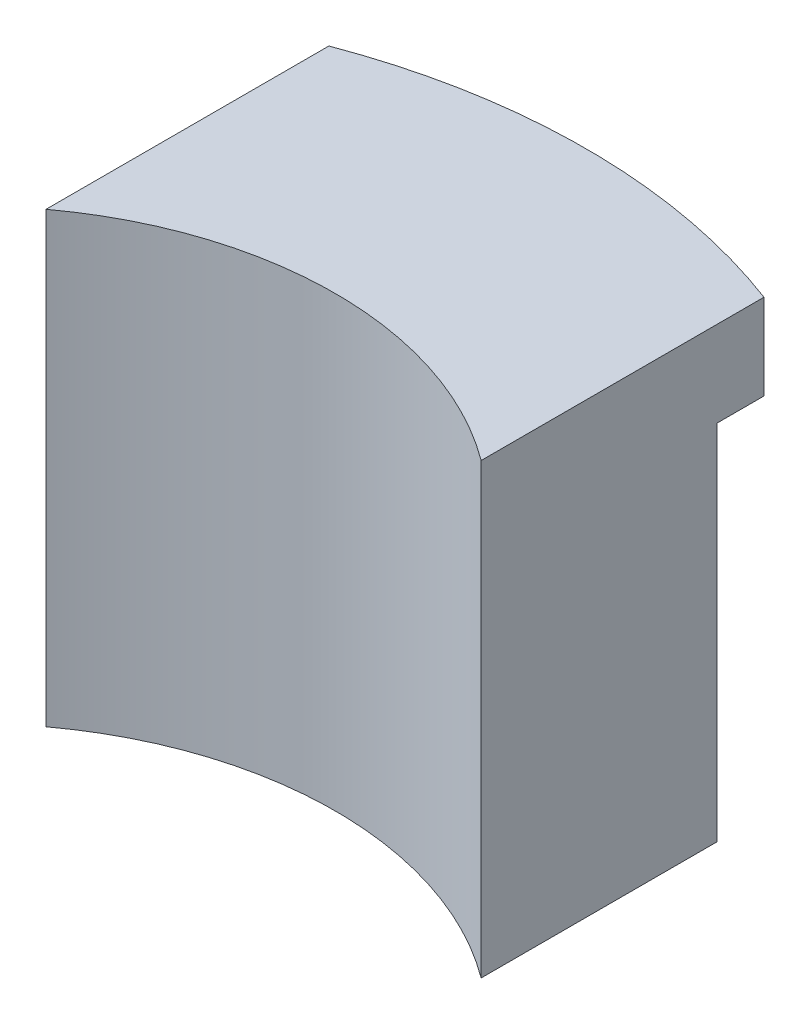
ISO-10303-21;
HEADER;
FILE_DESCRIPTION(('STEP AP214'),'2;1');
FILE_NAME('part.step','',(''),(''),'','','');
FILE_SCHEMA(('AUTOMOTIVE_DESIGN { 1 0 10303 214 1 1 1 1 }'));
ENDSEC;
DATA;
#1=APPLICATION_CONTEXT('core data for automotive mechanical design processes');
#2=APPLICATION_PROTOCOL_DEFINITION('international standard','automotive_design',2000,#1);
#3=PRODUCT_CONTEXT('',#1,'mechanical');
#4=PRODUCT('Part','Part','',(#3));
#5=PRODUCT_RELATED_PRODUCT_CATEGORY('part','',(#4));
#6=PRODUCT_DEFINITION_FORMATION('','',#4);
#7=PRODUCT_DEFINITION_CONTEXT('part definition',#1,'design');
#8=PRODUCT_DEFINITION('design','',#6,#7);
#9=PRODUCT_DEFINITION_SHAPE('','',#8);
#10=(LENGTH_UNIT() NAMED_UNIT(*) SI_UNIT(.MILLI.,.METRE.));
#11=(NAMED_UNIT(*) PLANE_ANGLE_UNIT() SI_UNIT($,.RADIAN.));
#12=(NAMED_UNIT(*) SI_UNIT($,.STERADIAN.) SOLID_ANGLE_UNIT());
#13=UNCERTAINTY_MEASURE_WITH_UNIT(LENGTH_MEASURE(1.E-05),#10,'distance_accuracy_value','');
#14=(GEOMETRIC_REPRESENTATION_CONTEXT(3) GLOBAL_UNCERTAINTY_ASSIGNED_CONTEXT((#13)) GLOBAL_UNIT_ASSIGNED_CONTEXT((#10,
#11,#12)) REPRESENTATION_CONTEXT('',''));
#15=CARTESIAN_POINT('',(0.,0.,0.));
#16=DIRECTION('',(0.,0.,1.));
#17=DIRECTION('',(1.,0.,0.));
#18=AXIS2_PLACEMENT_3D('',#15,#16,#17);
#19=CARTESIAN_POINT('',(0.,-28.,0.));
#20=DIRECTION('',(0.,1.,0.));
#21=DIRECTION('',(0.,0.,1.));
#22=AXIS2_PLACEMENT_3D('',#19,#20,#21);
#23=PLANE('',#22);
#24=DIRECTION('',(0.,0.,-1.));
#25=VECTOR('',#24,1.);
#26=CARTESIAN_POINT('',(14.5,-28.,-36.5149343014672));
#27=LINE('',#26,#25);
#28=CARTESIAN_POINT('',(14.5,-28.,-21.2339353582855));
#29=VERTEX_POINT('',#28);
#30=CARTESIAN_POINT('',(14.5,-28.,-35.6149343014672));
#31=VERTEX_POINT('',#30);
#32=EDGE_CURVE('E57',#29,#31,#27,.T.);
#33=ORIENTED_EDGE('',*,*,#32,.F.);
#34=CARTESIAN_POINT('',(0.,-28.,0.));
#35=DIRECTION('',(0.,-1.,0.));
#36=DIRECTION('',(0.,0.,1.));
#37=AXIS2_PLACEMENT_3D('',#34,#35,#36);
#38=CIRCLE('',#37,25.7124485570676);
#39=CARTESIAN_POINT('',(-14.5,-28.,-21.2339353582855));
#40=VERTEX_POINT('',#39);
#41=EDGE_CURVE('E230',#40,#29,#38,.T.);
#42=ORIENTED_EDGE('',*,*,#41,.F.);
#43=DIRECTION('',(0.,0.,1.));
#44=VECTOR('',#43,1.);
#45=CARTESIAN_POINT('',(-14.5,-28.,-36.5149343014672));
#46=LINE('',#45,#44);
#47=CARTESIAN_POINT('',(-14.5,-28.,-35.6149343014672));
#48=VERTEX_POINT('',#47);
#49=EDGE_CURVE('E11',#48,#40,#46,.T.);
#50=ORIENTED_EDGE('',*,*,#49,.F.);
#51=DIRECTION('',(1.,0.,0.));
#52=VECTOR('',#51,1.);
#53=CARTESIAN_POINT('',(-13.,-28.,-35.6149343014672));
#54=LINE('',#53,#52);
#55=CARTESIAN_POINT('',(-13.,-28.,-35.6149343014672));
#56=VERTEX_POINT('',#55);
#57=EDGE_CURVE('E260',#48,#56,#54,.T.);
#58=ORIENTED_EDGE('',*,*,#57,.T.);
#59=DIRECTION('',(0.,0.,1.));
#60=VECTOR('',#59,1.);
#61=CARTESIAN_POINT('',(-13.,-28.,-23.9064291869583));
#62=LINE('',#61,#60);
#63=CARTESIAN_POINT('',(-13.,-28.,-23.9064291869583));
#64=VERTEX_POINT('',#63);
#65=EDGE_CURVE('E262',#56,#64,#62,.T.);
#66=ORIENTED_EDGE('',*,*,#65,.T.);
#67=CARTESIAN_POINT('',(0.,-28.,0.));
#68=DIRECTION('',(0.,-1.,0.));
#69=DIRECTION('',(0.,0.,1.));
#70=AXIS2_PLACEMENT_3D('',#67,#68,#69);
#71=CIRCLE('',#70,27.2124485570676);
#72=CARTESIAN_POINT('',(13.,-28.,-23.9064291869583));
#73=VERTEX_POINT('',#72);
#74=EDGE_CURVE('E266',#64,#73,#71,.T.);
#75=ORIENTED_EDGE('',*,*,#74,.T.);
#76=DIRECTION('',(0.,0.,-1.));
#77=VECTOR('',#76,1.);
#78=CARTESIAN_POINT('',(13.,-28.,-35.6149343014672));
#79=LINE('',#78,#77);
#80=CARTESIAN_POINT('',(13.,-28.,-35.6149343014672));
#81=VERTEX_POINT('',#80);
#82=EDGE_CURVE('E269',#73,#81,#79,.T.);
#83=ORIENTED_EDGE('',*,*,#82,.T.);
#84=DIRECTION('',(1.,0.,0.));
#85=VECTOR('',#84,1.);
#86=CARTESIAN_POINT('',(15.,-28.,-35.6149343014672));
#87=LINE('',#86,#85);
#88=EDGE_CURVE('E271',#81,#31,#87,.T.);
#89=ORIENTED_EDGE('',*,*,#88,.T.);
#90=EDGE_LOOP('',(#33,#42,#50,#58,#66,#75,#83,#89));
#91=FACE_BOUND('',#90,.T.);
#92=ADVANCED_FACE('F35',(#91),#23,.F.);
#93=CARTESIAN_POINT('',(0.,-3.9,0.));
#94=DIRECTION('',(0.,-1.,0.));
#95=DIRECTION('',(0.,0.,-1.));
#96=AXIS2_PLACEMENT_3D('',#93,#94,#95);
#97=PLANE('',#96);
#98=DIRECTION('',(0.,0.,-1.));
#99=VECTOR('',#98,1.);
#100=CARTESIAN_POINT('',(-14.5,-3.9,0.));
#101=LINE('',#100,#99);
#102=CARTESIAN_POINT('',(-14.5,-3.9,-36.5149343014672));
#103=VERTEX_POINT('',#102);
#104=CARTESIAN_POINT('',(-14.5,-3.9,-39.4176356470045));
#105=VERTEX_POINT('',#104);
#106=EDGE_CURVE('E506',#103,#105,#101,.T.);
#107=ORIENTED_EDGE('',*,*,#106,.F.);
#108=DIRECTION('',(1.,0.,0.));
#109=VECTOR('',#108,1.);
#110=CARTESIAN_POINT('',(-15.,-3.9,-36.5149343014672));
#111=LINE('',#110,#109);
#112=CARTESIAN_POINT('',(-15.,-3.9,-36.5149343014672));
#113=VERTEX_POINT('',#112);
#114=EDGE_CURVE('E254',#113,#103,#111,.T.);
#115=ORIENTED_EDGE('',*,*,#114,.F.);
#116=DIRECTION('',(0.,0.,-1.));
#117=VECTOR('',#116,1.);
#118=CARTESIAN_POINT('',(-15.,-3.9,0.));
#119=LINE('',#118,#117);
#120=CARTESIAN_POINT('',(-15.,-3.9,-39.7649343014672));
#121=VERTEX_POINT('',#120);
#122=EDGE_CURVE('E459',#113,#121,#119,.T.);
#123=ORIENTED_EDGE('',*,*,#122,.T.);
#124=CARTESIAN_POINT('',(0.,-3.9,0.));
#125=DIRECTION('',(0.,-1.,0.));
#126=DIRECTION('',(0.,0.,-1.));
#127=AXIS2_PLACEMENT_3D('',#124,#125,#126);
#128=CIRCLE('',#127,42.5);
#129=CARTESIAN_POINT('',(-3.25,-3.9,-42.3755530937355));
#130=VERTEX_POINT('',#129);
#131=EDGE_CURVE('E458',#121,#130,#128,.T.);
#132=ORIENTED_EDGE('',*,*,#131,.T.);
#133=DIRECTION('',(0.,0.,-1.));
#134=VECTOR('',#133,1.);
#135=CARTESIAN_POINT('',(-3.25,-3.9,-29.1));
#136=LINE('',#135,#134);
#137=CARTESIAN_POINT('',(-3.25,-3.9,-41.8740671537886));
#138=VERTEX_POINT('',#137);
#139=EDGE_CURVE('E290',#130,#138,#136,.F.);
#140=ORIENTED_EDGE('',*,*,#139,.T.);
#141=CARTESIAN_POINT('',(0.,-3.9,0.));
#142=DIRECTION('',(0.,-1.,0.));
#143=DIRECTION('',(0.,0.,-1.));
#144=AXIS2_PLACEMENT_3D('',#141,#142,#143);
#145=CIRCLE('',#144,42.);
#146=EDGE_CURVE('E337',#105,#138,#145,.T.);
#147=ORIENTED_EDGE('',*,*,#146,.F.);
#148=EDGE_LOOP('',(#107,#115,#123,#132,#140,#147));
#149=FACE_BOUND('',#148,.T.);
#150=ADVANCED_FACE('F368',(#149),#97,.T.);
#151=CARTESIAN_POINT('',(-13.,-28.,-35.6149343014672));
#152=DIRECTION('',(0.,0.,1.));
#153=DIRECTION('',(1.,0.,0.));
#154=AXIS2_PLACEMENT_3D('',#151,#152,#153);
#155=PLANE('',#154);
#156=ORIENTED_EDGE('',*,*,#57,.F.);
#157=DIRECTION('',(0.,-1.,0.));
#158=VECTOR('',#157,1.);
#159=CARTESIAN_POINT('',(-14.5,-3.9,-35.6149343014672));
#160=LINE('',#159,#158);
#161=CARTESIAN_POINT('',(-14.5,-3.,-35.6149343014672));
#162=VERTEX_POINT('',#161);
#163=EDGE_CURVE('E285',#162,#48,#160,.T.);
#164=ORIENTED_EDGE('',*,*,#163,.F.);
#165=DIRECTION('',(1.,0.,0.));
#166=VECTOR('',#165,1.);
#167=CARTESIAN_POINT('',(-13.,-3.,-35.6149343014672));
#168=LINE('',#167,#166);
#169=CARTESIAN_POINT('',(-13.,-3.,-35.6149343014672));
#170=VERTEX_POINT('',#169);
#171=EDGE_CURVE('E259',#162,#170,#168,.T.);
#172=ORIENTED_EDGE('',*,*,#171,.T.);
#173=DIRECTION('',(0.,1.,0.));
#174=VECTOR('',#173,1.);
#175=CARTESIAN_POINT('',(-13.,-28.,-35.6149343014672));
#176=LINE('',#175,#174);
#177=EDGE_CURVE('E280',#56,#170,#176,.T.);
#178=ORIENTED_EDGE('',*,*,#177,.F.);
#179=EDGE_LOOP('',(#156,#164,#172,#178));
#180=FACE_BOUND('',#179,.T.);
#181=ADVANCED_FACE('F318',(#180),#155,.F.);
#182=CARTESIAN_POINT('',(15.,-28.,-35.6149343014672));
#183=DIRECTION('',(0.,0.,1.));
#184=DIRECTION('',(1.,0.,0.));
#185=AXIS2_PLACEMENT_3D('',#182,#183,#184);
#186=PLANE('',#185);
#187=DIRECTION('',(0.,-1.,0.));
#188=VECTOR('',#187,1.);
#189=CARTESIAN_POINT('',(14.5,-3.9,-35.6149343014672));
#190=LINE('',#189,#188);
#191=CARTESIAN_POINT('',(14.5,-3.,-35.6149343014672));
#192=VERTEX_POINT('',#191);
#193=EDGE_CURVE('E283',#192,#31,#190,.T.);
#194=ORIENTED_EDGE('',*,*,#193,.T.);
#195=ORIENTED_EDGE('',*,*,#88,.F.);
#196=DIRECTION('',(0.,1.,0.));
#197=VECTOR('',#196,1.);
#198=CARTESIAN_POINT('',(13.,-28.,-35.6149343014672));
#199=LINE('',#198,#197);
#200=CARTESIAN_POINT('',(13.,-3.,-35.6149343014672));
#201=VERTEX_POINT('',#200);
#202=EDGE_CURVE('E273',#81,#201,#199,.T.);
#203=ORIENTED_EDGE('',*,*,#202,.T.);
#204=DIRECTION('',(1.,0.,0.));
#205=VECTOR('',#204,1.);
#206=CARTESIAN_POINT('',(15.,-3.,-35.6149343014672));
#207=LINE('',#206,#205);
#208=EDGE_CURVE('E263',#201,#192,#207,.T.);
#209=ORIENTED_EDGE('',*,*,#208,.T.);
#210=EDGE_LOOP('',(#194,#195,#203,#209));
#211=FACE_BOUND('',#210,.T.);
#212=ADVANCED_FACE('F376',(#211),#186,.F.);
#213=CARTESIAN_POINT('',(0.,-3.,0.));
#214=DIRECTION('',(0.,-1.,0.));
#215=DIRECTION('',(0.,0.,-1.));
#216=AXIS2_PLACEMENT_3D('',#213,#214,#215);
#217=PLANE('',#216);
#218=DIRECTION('',(0.,0.,-1.));
#219=VECTOR('',#218,1.);
#220=CARTESIAN_POINT('',(-13.,-3.,0.));
#221=LINE('',#220,#219);
#222=CARTESIAN_POINT('',(-13.,-3.,-38.3568768280213));
#223=VERTEX_POINT('',#222);
#224=EDGE_CURVE('E482',#170,#223,#221,.T.);
#225=ORIENTED_EDGE('',*,*,#224,.F.);
#226=ORIENTED_EDGE('',*,*,#171,.F.);
#227=DIRECTION('',(0.,0.,-1.));
#228=VECTOR('',#227,1.);
#229=CARTESIAN_POINT('',(-14.5,-3.,0.));
#230=LINE('',#229,#228);
#231=CARTESIAN_POINT('',(-14.5,-3.,-39.4176356470045));
#232=VERTEX_POINT('',#231);
#233=EDGE_CURVE('E404',#162,#232,#230,.T.);
#234=ORIENTED_EDGE('',*,*,#233,.T.);
#235=CARTESIAN_POINT('',(0.,-3.,0.));
#236=DIRECTION('',(0.,-1.,0.));
#237=DIRECTION('',(0.,0.,-1.));
#238=AXIS2_PLACEMENT_3D('',#235,#236,#237);
#239=CIRCLE('',#238,42.);
#240=CARTESIAN_POINT('',(-3.12289929392544,-3.,-41.8837378943188));
#241=VERTEX_POINT('',#240);
#242=EDGE_CURVE('E468',#232,#241,#239,.T.);
#243=ORIENTED_EDGE('',*,*,#242,.T.);
#244=DIRECTION('',(0.,0.,-1.));
#245=VECTOR('',#244,1.);
#246=CARTESIAN_POINT('',(-3.12289929392544,-3.,-29.1));
#247=LINE('',#246,#245);
#248=CARTESIAN_POINT('',(-3.12289929392544,-3.,-40.3794192627878));
#249=VERTEX_POINT('',#248);
#250=EDGE_CURVE('E336',#241,#249,#247,.F.);
#251=ORIENTED_EDGE('',*,*,#250,.T.);
#252=CARTESIAN_POINT('',(0.,-3.,0.));
#253=DIRECTION('',(0.,-1.,0.));
#254=DIRECTION('',(0.,0.,-1.));
#255=AXIS2_PLACEMENT_3D('',#252,#253,#254);
#256=CIRCLE('',#255,40.5);
#257=EDGE_CURVE('E479',#223,#249,#256,.T.);
#258=ORIENTED_EDGE('',*,*,#257,.F.);
#259=EDGE_LOOP('',(#225,#226,#234,#243,#251,#258));
#260=FACE_BOUND('',#259,.T.);
#261=ADVANCED_FACE('F378',(#260),#217,.T.);
#262=DIRECTION('',(0.,0.,-1.));
#263=VECTOR('',#262,1.);
#264=CARTESIAN_POINT('',(14.5,-3.,0.));
#265=LINE('',#264,#263);
#266=CARTESIAN_POINT('',(14.5,-3.,-39.4176356470045));
#267=VERTEX_POINT('',#266);
#268=EDGE_CURVE('E472',#192,#267,#265,.T.);
#269=ORIENTED_EDGE('',*,*,#268,.F.);
#270=ORIENTED_EDGE('',*,*,#208,.F.);
#271=DIRECTION('',(0.,0.,-1.));
#272=VECTOR('',#271,1.);
#273=CARTESIAN_POINT('',(13.,-3.,0.));
#274=LINE('',#273,#272);
#275=CARTESIAN_POINT('',(13.,-3.,-38.3568768280213));
#276=VERTEX_POINT('',#275);
#277=EDGE_CURVE('E424',#201,#276,#274,.T.);
#278=ORIENTED_EDGE('',*,*,#277,.T.);
#279=CARTESIAN_POINT('',(3.12289929392544,-3.,-40.3794192627878));
#280=VERTEX_POINT('',#279);
#281=EDGE_CURVE('E483',#280,#276,#256,.T.);
#282=ORIENTED_EDGE('',*,*,#281,.F.);
#283=DIRECTION('',(0.,0.,-1.));
#284=VECTOR('',#283,1.);
#285=CARTESIAN_POINT('',(3.12289929392544,-3.,-29.1));
#286=LINE('',#285,#284);
#287=CARTESIAN_POINT('',(3.12289929392544,-3.,-41.8837378943188));
#288=VERTEX_POINT('',#287);
#289=EDGE_CURVE('E794',#280,#288,#286,.T.);
#290=ORIENTED_EDGE('',*,*,#289,.T.);
#291=EDGE_CURVE('E335',#288,#267,#239,.T.);
#292=ORIENTED_EDGE('',*,*,#291,.T.);
#293=EDGE_LOOP('',(#269,#270,#278,#282,#290,#292));
#294=FACE_BOUND('',#293,.T.);
#295=ADVANCED_FACE('F384',(#294),#217,.T.);
#296=DIRECTION('',(1.,0.,0.));
#297=VECTOR('',#296,1.);
#298=CARTESIAN_POINT('',(15.,-3.9,-36.5149343014672));
#299=LINE('',#298,#297);
#300=CARTESIAN_POINT('',(14.5,-3.9,-36.5149343014672));
#301=VERTEX_POINT('',#300);
#302=CARTESIAN_POINT('',(15.,-3.9,-36.5149343014672));
#303=VERTEX_POINT('',#302);
#304=EDGE_CURVE('E207',#301,#303,#299,.T.);
#305=ORIENTED_EDGE('',*,*,#304,.F.);
#306=DIRECTION('',(0.,0.,-1.));
#307=VECTOR('',#306,1.);
#308=CARTESIAN_POINT('',(14.5,-3.9,0.));
#309=LINE('',#308,#307);
#310=CARTESIAN_POINT('',(14.5,-3.9,-39.4176356470045));
#311=VERTEX_POINT('',#310);
#312=EDGE_CURVE('E462',#301,#311,#309,.T.);
#313=ORIENTED_EDGE('',*,*,#312,.T.);
#314=CARTESIAN_POINT('',(3.25,-3.9,-41.8740671537886));
#315=VERTEX_POINT('',#314);
#316=EDGE_CURVE('E455',#315,#311,#145,.T.);
#317=ORIENTED_EDGE('',*,*,#316,.F.);
#318=DIRECTION('',(0.,0.,-1.));
#319=VECTOR('',#318,1.);
#320=CARTESIAN_POINT('',(3.25,-3.9,-29.1));
#321=LINE('',#320,#319);
#322=CARTESIAN_POINT('',(3.25,-3.9,-42.3755530937355));
#323=VERTEX_POINT('',#322);
#324=EDGE_CURVE('E287',#315,#323,#321,.T.);
#325=ORIENTED_EDGE('',*,*,#324,.T.);
#326=CARTESIAN_POINT('',(15.,-3.9,-39.7649343014672));
#327=VERTEX_POINT('',#326);
#328=EDGE_CURVE('E453',#323,#327,#128,.T.);
#329=ORIENTED_EDGE('',*,*,#328,.T.);
#330=DIRECTION('',(0.,0.,1.));
#331=VECTOR('',#330,1.);
#332=CARTESIAN_POINT('',(15.,-3.9,0.));
#333=LINE('',#332,#331);
#334=EDGE_CURVE('E461',#327,#303,#333,.T.);
#335=ORIENTED_EDGE('',*,*,#334,.T.);
#336=EDGE_LOOP('',(#305,#313,#317,#325,#329,#335));
#337=FACE_BOUND('',#336,.T.);
#338=ADVANCED_FACE('F320',(#337),#97,.T.);
#339=CARTESIAN_POINT('',(-14.5,-3.9,0.));
#340=DIRECTION('',(1.,0.,0.));
#341=DIRECTION('',(0.,0.,-1.));
#342=AXIS2_PLACEMENT_3D('',#339,#340,#341);
#343=PLANE('',#342);
#344=ORIENTED_EDGE('',*,*,#233,.F.);
#345=ORIENTED_EDGE('',*,*,#163,.T.);
#346=ORIENTED_EDGE('',*,*,#49,.T.);
#347=DIRECTION('',(0.,1.,0.));
#348=VECTOR('',#347,1.);
#349=CARTESIAN_POINT('',(-14.5,-28.9,-21.2339353582855));
#350=LINE('',#349,#348);
#351=CARTESIAN_POINT('',(-14.5,-28.9,-21.2339353582855));
#352=VERTEX_POINT('',#351);
#353=EDGE_CURVE('E249',#352,#40,#350,.T.);
#354=ORIENTED_EDGE('',*,*,#353,.F.);
#355=DIRECTION('',(0.,0.,1.));
#356=VECTOR('',#355,1.);
#357=CARTESIAN_POINT('',(-14.5,-28.9,-36.5149343014672));
#358=LINE('',#357,#356);
#359=CARTESIAN_POINT('',(-14.5,-28.9,-36.5149343014672));
#360=VERTEX_POINT('',#359);
#361=EDGE_CURVE('E240',#360,#352,#358,.T.);
#362=ORIENTED_EDGE('',*,*,#361,.F.);
#363=DIRECTION('',(0.,-1.,0.));
#364=VECTOR('',#363,1.);
#365=CARTESIAN_POINT('',(-14.5,-3.9,-36.5149343014672));
#366=LINE('',#365,#364);
#367=EDGE_CURVE('E212',#103,#360,#366,.T.);
#368=ORIENTED_EDGE('',*,*,#367,.F.);
#369=ORIENTED_EDGE('',*,*,#106,.T.);
#370=DIRECTION('',(0.,1.,0.));
#371=VECTOR('',#370,1.);
#372=CARTESIAN_POINT('',(-14.5,-3.9,-39.4176356470045));
#373=LINE('',#372,#371);
#374=EDGE_CURVE('E476',#105,#232,#373,.T.);
#375=ORIENTED_EDGE('',*,*,#374,.T.);
#376=EDGE_LOOP('',(#344,#345,#346,#354,#362,#368,#369,#375));
#377=FACE_BOUND('',#376,.T.);
#378=ADVANCED_FACE('F399',(#377),#343,.T.);
#379=CARTESIAN_POINT('',(14.5,-3.9,0.));
#380=DIRECTION('',(1.,0.,0.));
#381=DIRECTION('',(0.,0.,-1.));
#382=AXIS2_PLACEMENT_3D('',#379,#380,#381);
#383=PLANE('',#382);
#384=ORIENTED_EDGE('',*,*,#193,.F.);
#385=ORIENTED_EDGE('',*,*,#268,.T.);
#386=DIRECTION('',(0.,1.,0.));
#387=VECTOR('',#386,1.);
#388=CARTESIAN_POINT('',(14.5,-3.9,-39.4176356470045));
#389=LINE('',#388,#387);
#390=EDGE_CURVE('E467',#311,#267,#389,.T.);
#391=ORIENTED_EDGE('',*,*,#390,.F.);
#392=ORIENTED_EDGE('',*,*,#312,.F.);
#393=DIRECTION('',(0.,1.,0.));
#394=VECTOR('',#393,1.);
#395=CARTESIAN_POINT('',(14.5,-3.9,-36.5149343014672));
#396=LINE('',#395,#394);
#397=CARTESIAN_POINT('',(14.5,-28.9,-36.5149343014672));
#398=VERTEX_POINT('',#397);
#399=EDGE_CURVE('E211',#398,#301,#396,.T.);
#400=ORIENTED_EDGE('',*,*,#399,.F.);
#401=DIRECTION('',(0.,0.,-1.));
#402=VECTOR('',#401,1.);
#403=CARTESIAN_POINT('',(14.5,-28.9,-36.5149343014672));
#404=LINE('',#403,#402);
#405=CARTESIAN_POINT('',(14.5,-28.9,-21.2339353582855));
#406=VERTEX_POINT('',#405);
#407=EDGE_CURVE('E228',#406,#398,#404,.T.);
#408=ORIENTED_EDGE('',*,*,#407,.F.);
#409=DIRECTION('',(0.,1.,0.));
#410=VECTOR('',#409,1.);
#411=CARTESIAN_POINT('',(14.5,-28.9,-21.2339353582855));
#412=LINE('',#411,#410);
#413=EDGE_CURVE('E244',#406,#29,#412,.T.);
#414=ORIENTED_EDGE('',*,*,#413,.T.);
#415=ORIENTED_EDGE('',*,*,#32,.T.);
#416=EDGE_LOOP('',(#384,#385,#391,#392,#400,#408,#414,#415));
#417=FACE_BOUND('',#416,.T.);
#418=ADVANCED_FACE('F359',(#417),#383,.F.);
#419=CARTESIAN_POINT('',(15.,2.,-39.7649343014672));
#420=DIRECTION('',(-1.,0.,0.));
#421=DIRECTION('',(0.,0.,1.));
#422=AXIS2_PLACEMENT_3D('',#419,#420,#421);
#423=PLANE('',#422);
#424=DIRECTION('',(0.,-1.,0.));
#425=VECTOR('',#424,1.);
#426=CARTESIAN_POINT('',(15.,2.,-20.2649343014672));
#427=LINE('',#426,#425);
#428=CARTESIAN_POINT('',(15.,2.,-20.2649343014672));
#429=VERTEX_POINT('',#428);
#430=CARTESIAN_POINT('',(15.,-28.9,-20.2649343014672));
#431=VERTEX_POINT('',#430);
#432=EDGE_CURVE('E219',#429,#431,#427,.T.);
#433=ORIENTED_EDGE('',*,*,#432,.T.);
#434=DIRECTION('',(0.,0.,1.));
#435=VECTOR('',#434,1.);
#436=CARTESIAN_POINT('',(15.,-28.9,-36.5149343014672));
#437=LINE('',#436,#435);
#438=CARTESIAN_POINT('',(15.,-28.9,-36.5149343014672));
#439=VERTEX_POINT('',#438);
#440=EDGE_CURVE('E215',#439,#431,#437,.T.);
#441=ORIENTED_EDGE('',*,*,#440,.F.);
#442=DIRECTION('',(0.,-1.,0.));
#443=VECTOR('',#442,1.);
#444=CARTESIAN_POINT('',(15.,-3.9,-36.5149343014672));
#445=LINE('',#444,#443);
#446=EDGE_CURVE('E201',#303,#439,#445,.T.);
#447=ORIENTED_EDGE('',*,*,#446,.F.);
#448=ORIENTED_EDGE('',*,*,#334,.F.);
#449=DIRECTION('',(0.,-1.,0.));
#450=VECTOR('',#449,1.);
#451=CARTESIAN_POINT('',(15.,2.,-39.7649343014672));
#452=LINE('',#451,#450);
#453=CARTESIAN_POINT('',(15.,2.,-39.7649343014672));
#454=VERTEX_POINT('',#453);
#455=EDGE_CURVE('E438',#454,#327,#452,.T.);
#456=ORIENTED_EDGE('',*,*,#455,.F.);
#457=DIRECTION('',(0.,0.,-1.));
#458=VECTOR('',#457,1.);
#459=CARTESIAN_POINT('',(15.,2.,-39.7649343014672));
#460=LINE('',#459,#458);
#461=EDGE_CURVE('E436',#429,#454,#460,.T.);
#462=ORIENTED_EDGE('',*,*,#461,.F.);
#463=EDGE_LOOP('',(#433,#441,#447,#448,#456,#462));
#464=FACE_BOUND('',#463,.T.);
#465=ADVANCED_FACE('F216',(#464),#423,.F.);
#466=CARTESIAN_POINT('',(-15.,2.,-39.7649343014672));
#467=DIRECTION('',(1.,0.,0.));
#468=DIRECTION('',(0.,0.,-1.));
#469=AXIS2_PLACEMENT_3D('',#466,#467,#468);
#470=PLANE('',#469);
#471=ORIENTED_EDGE('',*,*,#122,.F.);
#472=DIRECTION('',(0.,1.,0.));
#473=VECTOR('',#472,1.);
#474=CARTESIAN_POINT('',(-15.,-3.9,-36.5149343014672));
#475=LINE('',#474,#473);
#476=CARTESIAN_POINT('',(-15.,-28.9,-36.5149343014672));
#477=VERTEX_POINT('',#476);
#478=EDGE_CURVE('E252',#477,#113,#475,.T.);
#479=ORIENTED_EDGE('',*,*,#478,.F.);
#480=DIRECTION('',(0.,0.,-1.));
#481=VECTOR('',#480,1.);
#482=CARTESIAN_POINT('',(-15.,-28.9,-20.2649343014672));
#483=LINE('',#482,#481);
#484=CARTESIAN_POINT('',(-15.,-28.9,-20.2649343014672));
#485=VERTEX_POINT('',#484);
#486=EDGE_CURVE('E234',#485,#477,#483,.T.);
#487=ORIENTED_EDGE('',*,*,#486,.F.);
#488=DIRECTION('',(0.,-1.,0.));
#489=VECTOR('',#488,1.);
#490=CARTESIAN_POINT('',(-15.,2.,-20.2649343014672));
#491=LINE('',#490,#489);
#492=CARTESIAN_POINT('',(-15.,2.,-20.2649343014672));
#493=VERTEX_POINT('',#492);
#494=EDGE_CURVE('E442',#493,#485,#491,.T.);
#495=ORIENTED_EDGE('',*,*,#494,.F.);
#496=DIRECTION('',(0.,0.,1.));
#497=VECTOR('',#496,1.);
#498=CARTESIAN_POINT('',(-15.,2.,-39.7649343014672));
#499=LINE('',#498,#497);
#500=CARTESIAN_POINT('',(-15.,2.,-39.7649343014672));
#501=VERTEX_POINT('',#500);
#502=EDGE_CURVE('E432',#501,#493,#499,.T.);
#503=ORIENTED_EDGE('',*,*,#502,.F.);
#504=DIRECTION('',(0.,-1.,0.));
#505=VECTOR('',#504,1.);
#506=CARTESIAN_POINT('',(-15.,2.,-39.7649343014672));
#507=LINE('',#506,#505);
#508=EDGE_CURVE('E443',#501,#121,#507,.T.);
#509=ORIENTED_EDGE('',*,*,#508,.T.);
#510=EDGE_LOOP('',(#471,#479,#487,#495,#503,#509));
#511=FACE_BOUND('',#510,.T.);
#512=ADVANCED_FACE('F358',(#511),#470,.F.);
#513=CARTESIAN_POINT('',(0.,2.,0.));
#514=DIRECTION('',(0.,-1.,0.));
#515=DIRECTION('',(0.,0.,-1.));
#516=AXIS2_PLACEMENT_3D('',#513,#514,#515);
#517=CYLINDRICAL_SURFACE('',#516,25.2124485570676);
#518=ORIENTED_EDGE('',*,*,#494,.T.);
#519=CARTESIAN_POINT('',(0.,-28.9,0.));
#520=DIRECTION('',(0.,1.,0.));
#521=DIRECTION('',(0.,0.,1.));
#522=AXIS2_PLACEMENT_3D('',#519,#520,#521);
#523=CIRCLE('',#522,25.2124485570676);
#524=EDGE_CURVE('E223',#431,#485,#523,.T.);
#525=ORIENTED_EDGE('',*,*,#524,.F.);
#526=ORIENTED_EDGE('',*,*,#432,.F.);
#527=CARTESIAN_POINT('',(0.,2.,0.));
#528=DIRECTION('',(0.,-1.,0.));
#529=DIRECTION('',(0.,0.,-1.));
#530=AXIS2_PLACEMENT_3D('',#527,#528,#529);
#531=CIRCLE('',#530,25.2124485570676);
#532=EDGE_CURVE('E434',#493,#429,#531,.T.);
#533=ORIENTED_EDGE('',*,*,#532,.F.);
#534=EDGE_LOOP('',(#518,#525,#526,#533));
#535=FACE_BOUND('',#534,.T.);
#536=ADVANCED_FACE('F344',(#535),#517,.F.);
#537=CARTESIAN_POINT('',(0.,-3.,0.));
#538=DIRECTION('',(0.,1.,0.));
#539=DIRECTION('',(0.,0.,1.));
#540=AXIS2_PLACEMENT_3D('',#537,#538,#539);
#541=CYLINDRICAL_SURFACE('',#540,40.5);
#542=ORIENTED_EDGE('',*,*,#257,.T.);
#543=CARTESIAN_POINT('',(-3.12289929392544,-3.,-40.3794192627878));
#544=CARTESIAN_POINT('',(-3.0975889071585,-2.91214412213219,-40.3813750675647));
#545=CARTESIAN_POINT('',(-3.06855736755213,-2.82537155619688,-40.3835980396194));
#546=CARTESIAN_POINT('',(-3.00329939188432,-2.65459493224941,-40.3885045423015));
#547=CARTESIAN_POINT('',(-2.9670734129186,-2.57059069874752,-40.391188043668));
#548=CARTESIAN_POINT('',(-2.88770072800352,-2.40600359823427,-40.3969399194026));
#549=CARTESIAN_POINT('',(-2.84455927895991,-2.32541819073001,-40.4000080010426));
#550=CARTESIAN_POINT('',(-2.75167034024079,-2.16819192769235,-40.4064410859657));
#551=CARTESIAN_POINT('',(-2.70192290161505,-2.09155104168282,-40.4098060869541));
#552=CARTESIAN_POINT('',(-2.54322192087093,-1.86830387082432,-40.4202084899321));
#553=CARTESIAN_POINT('',(-2.42477044729013,-1.72829184563476,-40.427556272351));
#554=CARTESIAN_POINT('',(-2.16613479881659,-1.47023132559973,-40.4422377735996));
#555=CARTESIAN_POINT('',(-2.02595426055939,-1.35217916275222,-40.4495714945752));
#556=CARTESIAN_POINT('',(-1.72754324545949,-1.14110278665245,-40.4634142147848));
#557=CARTESIAN_POINT('',(-1.5692908559956,-1.04810942666945,-40.4699221921677));
#558=CARTESIAN_POINT('',(-1.23934279645783,-0.890015701864663,-40.4813691934532));
#559=CARTESIAN_POINT('',(-1.06764531654984,-0.824919099865674,-40.4863080056775));
#560=CARTESIAN_POINT('',(-0.716011426512562,-0.724595420201303,-40.4940511488335));
#561=CARTESIAN_POINT('',(-0.536089947016121,-0.689316314887713,-40.4968591967923));
#562=CARTESIAN_POINT('',(-0.172871151618011,-0.649462890176328,-40.5000381151628));
#563=CARTESIAN_POINT('',(0.0104258650504582,-0.644885862127108,-40.5004092005723));
#564=CARTESIAN_POINT('',(0.374698784408457,-0.666533459038628,-40.4986752337229));
#565=CARTESIAN_POINT('',(0.555679485451458,-0.692677973369146,-40.4965766215175));
#566=CARTESIAN_POINT('',(0.910678651938681,-0.774882227236353,-40.4901494131724));
#567=CARTESIAN_POINT('',(1.08469685338067,-0.830943099980273,-40.4858207325597));
#568=CARTESIAN_POINT('',(1.42093554963594,-0.971406837553807,-40.4754157099364));
#569=CARTESIAN_POINT('',(1.58315002781092,-1.05582403485077,-40.4693384843617));
#570=CARTESIAN_POINT('',(1.89113850617576,-1.25060525182827,-40.4561168383474));
#571=CARTESIAN_POINT('',(2.03691147237743,-1.36097090203303,-40.4489723508546));
#572=CARTESIAN_POINT('',(2.30833864285989,-1.60490023756515,-40.4343930704246));
#573=CARTESIAN_POINT('',(2.43392875963175,-1.73853511718539,-40.4269574424743));
#574=CARTESIAN_POINT('',(2.66086506684057,-2.02499663577211,-40.4126558410573));
#575=CARTESIAN_POINT('',(2.76222425195146,-2.17781292068248,-40.405789563553));
#576=CARTESIAN_POINT('',(2.9075349186078,-2.44291616155947,-40.395539196769));
#577=CARTESIAN_POINT('',(2.95923251704003,-2.55102136750208,-40.391770536186));
#578=CARTESIAN_POINT('',(3.05035869678512,-2.7721230813566,-40.3849885825016));
#579=CARTESIAN_POINT('',(3.08980495251076,-2.88511227258192,-40.3819742024688));
#580=CARTESIAN_POINT('',(3.12289929392544,-3.,-40.3794192627878));
#581=B_SPLINE_CURVE_WITH_KNOTS('',3,(#543,#544,#545,#546,#547,#548,#549,#550,#551,#552,#553,
#554,#555,#556,#557,#558,#559,#560,#561,#562,#563,#564,#565,#566,#567,#568,#569,#570,#571,#572,
#573,#574,#575,#576,#577,#578,#579,#580),.UNSPECIFIED.,.F.,.F.,(4,2,2,2,2,2,2,2,2,2,2,2,2,2,2,2,
2,2,4),(0.,0.27425941825333,0.548501417119102,0.822535926596213,1.09656831851239,
1.64436570031725,2.19207150004967,2.74044860454131,3.28889965299814,3.83639173846684,
4.38383552151251,4.92985493200876,5.47589502674276,6.02221152921019,6.56856236977375,
7.11661517369317,7.66437340270193,8.0233627223765,8.38183171393756),.UNSPECIFIED.);
#582=EDGE_CURVE('E326',#249,#280,#581,.T.);
#583=ORIENTED_EDGE('',*,*,#582,.T.);
#584=ORIENTED_EDGE('',*,*,#281,.T.);
#585=DIRECTION('',(0.,1.,0.));
#586=VECTOR('',#585,1.);
#587=CARTESIAN_POINT('',(13.,-3.,-38.3568768280213));
#588=LINE('',#587,#586);
#589=CARTESIAN_POINT('',(13.,0.,-38.3568768280213));
#590=VERTEX_POINT('',#589);
#591=EDGE_CURVE('E420',#276,#590,#588,.T.);
#592=ORIENTED_EDGE('',*,*,#591,.T.);
#593=CARTESIAN_POINT('',(0.,0.,0.));
#594=DIRECTION('',(0.,-1.,0.));
#595=DIRECTION('',(0.,0.,-1.));
#596=AXIS2_PLACEMENT_3D('',#593,#594,#595);
#597=CIRCLE('',#596,40.5);
#598=CARTESIAN_POINT('',(-13.,0.,-38.3568768280213));
#599=VERTEX_POINT('',#598);
#600=EDGE_CURVE('E478',#599,#590,#597,.T.);
#601=ORIENTED_EDGE('',*,*,#600,.F.);
#602=DIRECTION('',(0.,1.,0.));
#603=VECTOR('',#602,1.);
#604=CARTESIAN_POINT('',(-13.,-3.,-38.3568768280213));
#605=LINE('',#604,#603);
#606=EDGE_CURVE('E422',#223,#599,#605,.T.);
#607=ORIENTED_EDGE('',*,*,#606,.F.);
#608=EDGE_LOOP('',(#542,#583,#584,#592,#601,#607));
#609=FACE_BOUND('',#608,.T.);
#610=ADVANCED_FACE('F339',(#609),#541,.F.);
#611=CARTESIAN_POINT('',(0.,-3.9,0.));
#612=DIRECTION('',(0.,1.,0.));
#613=DIRECTION('',(0.,0.,1.));
#614=AXIS2_PLACEMENT_3D('',#611,#612,#613);
#615=CYLINDRICAL_SURFACE('',#614,42.);
#616=ORIENTED_EDGE('',*,*,#146,.T.);
#617=CARTESIAN_POINT('',(-3.25,-3.9,-41.8740671537886));
#618=CARTESIAN_POINT('',(-3.25000448685459,-3.82381312106984,-41.8740657807527));
#619=CARTESIAN_POINT('',(-3.24732103754959,-3.74762693732345,-41.8742750796699));
#620=CARTESIAN_POINT('',(-3.23663843430752,-3.59600722311812,-41.8751026455452));
#621=CARTESIAN_POINT('',(-3.22866550275584,-3.52057183379597,-41.875718894994));
#622=CARTESIAN_POINT('',(-3.20746336305904,-3.37044784594156,-41.8773481845025));
#623=CARTESIAN_POINT('',(-3.19423415926085,-3.29575924679175,-41.8783612242341));
#624=CARTESIAN_POINT('',(-3.16251378324509,-3.14712771187935,-41.8807681612662));
#625=CARTESIAN_POINT('',(-3.14399691349237,-3.07319028995662,-41.8821639171785));
#626=CARTESIAN_POINT('',(-3.12289929392544,-3.,-41.8837378943188));
#627=B_SPLINE_CURVE_WITH_KNOTS('',3,(#617,#618,#619,#620,#621,#622,#623,#624,#625,#626),
.UNSPECIFIED.,.F.,.F.,(4,2,2,2,4),(0.,0.22851200379999,0.45589955051089,0.683286909172751,
0.911798724707246),.UNSPECIFIED.);
#628=EDGE_CURVE('E301',#138,#241,#627,.T.);
#629=ORIENTED_EDGE('',*,*,#628,.T.);
#630=ORIENTED_EDGE('',*,*,#242,.F.);
#631=ORIENTED_EDGE('',*,*,#374,.F.);
#632=EDGE_LOOP('',(#616,#629,#630,#631));
#633=FACE_BOUND('',#632,.T.);
#634=ADVANCED_FACE('F307',(#633),#615,.F.);
#635=ORIENTED_EDGE('',*,*,#291,.F.);
#636=CARTESIAN_POINT('',(3.12289929392544,-3.,-41.8837378943188));
#637=CARTESIAN_POINT('',(3.14399691349237,-3.07319028995662,-41.8821639171785));
#638=CARTESIAN_POINT('',(3.16251378324509,-3.14712771187935,-41.8807681612662));
#639=CARTESIAN_POINT('',(3.19423415926085,-3.29575924679175,-41.8783612242341));
#640=CARTESIAN_POINT('',(3.20746336305904,-3.37044784594156,-41.8773481845025));
#641=CARTESIAN_POINT('',(3.22866550275584,-3.52057183379597,-41.875718894994));
#642=CARTESIAN_POINT('',(3.23663843430752,-3.59600722311812,-41.8751026455452));
#643=CARTESIAN_POINT('',(3.24732103754959,-3.74762693732345,-41.8742750796699));
#644=CARTESIAN_POINT('',(3.25000448685459,-3.82381312106984,-41.8740657807527));
#645=CARTESIAN_POINT('',(3.25,-3.9,-41.8740671537886));
#646=B_SPLINE_CURVE_WITH_KNOTS('',3,(#636,#637,#638,#639,#640,#641,#642,#643,#644,#645),
.UNSPECIFIED.,.F.,.F.,(4,2,2,2,4),(0.,0.228511815534495,0.455899174196356,0.683286720907256,
0.911798724707246),.UNSPECIFIED.);
#647=EDGE_CURVE('E293',#288,#315,#646,.T.);
#648=ORIENTED_EDGE('',*,*,#647,.T.);
#649=ORIENTED_EDGE('',*,*,#316,.T.);
#650=ORIENTED_EDGE('',*,*,#390,.T.);
#651=EDGE_LOOP('',(#635,#648,#649,#650));
#652=FACE_BOUND('',#651,.T.);
#653=ADVANCED_FACE('F504',(#652),#615,.F.);
#654=CARTESIAN_POINT('',(0.,2.,0.));
#655=DIRECTION('',(0.,-1.,0.));
#656=DIRECTION('',(0.,0.,-1.));
#657=AXIS2_PLACEMENT_3D('',#654,#655,#656);
#658=CYLINDRICAL_SURFACE('',#657,42.5);
#659=CARTESIAN_POINT('',(-3.25,-3.9,-42.3755530937355));
#660=CARTESIAN_POINT('',(-3.25000891260286,-3.80873284907045,-42.3755502088245));
#661=CARTESIAN_POINT('',(-3.24615556932181,-3.71747003265599,-42.3758478856804));
#662=CARTESIAN_POINT('',(-3.23079336984904,-3.5355999525295,-42.3770230536147));
#663=CARTESIAN_POINT('',(-3.21928496312517,-3.44499265064458,-42.3779005106512));
#664=CARTESIAN_POINT('',(-3.18869421050249,-3.26514363483337,-42.3802129825718));
#665=CARTESIAN_POINT('',(-3.16961810410319,-3.17590085866307,-42.3816475381127));
#666=CARTESIAN_POINT('',(-3.12404876944821,-2.99936615264954,-42.3850308047817));
#667=CARTESIAN_POINT('',(-3.09755561425359,-2.91207420359899,-42.3869795108453));
#668=CARTESIAN_POINT('',(-3.0071724949123,-2.65397723517682,-42.3935209965484));
#669=CARTESIAN_POINT('',(-2.93236421332296,-2.48686537225342,-42.3988103227676));
#670=CARTESIAN_POINT('',(-2.75588428882172,-2.1676888782055,-42.4106456888971));
#671=CARTESIAN_POINT('',(-2.65421672820479,-2.01562196524881,-42.4171915377893));
#672=CARTESIAN_POINT('',(-2.42664533466873,-1.73038731794212,-42.4308186958873));
#673=CARTESIAN_POINT('',(-2.30069714005946,-1.59725496356665,-42.4379009705604));
#674=CARTESIAN_POINT('',(-2.02822445712719,-1.35398872078141,-42.4517947397856));
#675=CARTESIAN_POINT('',(-1.88169684127318,-1.24385833440496,-42.4586061929776));
#676=CARTESIAN_POINT('',(-1.57201907330452,-1.04961404645317,-42.471199213182));
#677=CARTESIAN_POINT('',(-1.4088493649629,-0.965531232848658,-42.4769795460828));
#678=CARTESIAN_POINT('',(-1.07066689092892,-0.825974851287145,-42.4868480463175));
#679=CARTESIAN_POINT('',(-0.895655026172785,-0.770499109702538,-42.4909363422113));
#680=CARTESIAN_POINT('',(-0.539109771046222,-0.689828177482216,-42.496953678449));
#681=CARTESIAN_POINT('',(-0.357589797094508,-0.66457400900867,-42.4988869238982));
#682=CARTESIAN_POINT('',(0.00712668298563938,-0.644880897885422,-42.5003905765942));
#683=CARTESIAN_POINT('',(0.19032320356744,-0.650442221143802,-42.4999609634517));
#684=CARTESIAN_POINT('',(0.55278267343173,-0.692174888032733,-42.4967907024473));
#685=CARTESIAN_POINT('',(0.732053077272709,-0.72828190716322,-42.4940549110823));
#686=CARTESIAN_POINT('',(1.08198044863664,-0.829980965491348,-42.4865857217725));
#687=CARTESIAN_POINT('',(1.25263738559112,-0.89557310932106,-42.481852316739));
#688=CARTESIAN_POINT('',(1.5807030008051,-1.05445404507987,-42.4709121018029));
#689=CARTESIAN_POINT('',(1.73809733771609,-1.14777233725929,-42.464703723966));
#690=CARTESIAN_POINT('',(2.03500514145947,-1.35943088960898,-42.4515120284156));
#691=CARTESIAN_POINT('',(2.17451913257025,-1.47777041584964,-42.444528733435));
#692=CARTESIAN_POINT('',(2.43207166400871,-1.73645577366471,-42.4305519529482));
#693=CARTESIAN_POINT('',(2.55005723535915,-1.87685434290307,-42.4235584838717));
#694=CARTESIAN_POINT('',(2.76082949589742,-2.17554881045971,-42.4103644606337));
#695=CARTESIAN_POINT('',(2.85360837949419,-2.33385023119451,-42.4041641523989));
#696=CARTESIAN_POINT('',(3.01132731471545,-2.66391327738106,-42.3932563823199));
#697=CARTESIAN_POINT('',(3.07624794584865,-2.83568419431933,-42.3885499624853));
#698=CARTESIAN_POINT('',(3.17621451742125,-3.18760159058186,-42.3811776117488));
#699=CARTESIAN_POINT('',(3.21130582040659,-3.36773491130578,-42.3785085831446));
#700=CARTESIAN_POINT('',(3.23735254025054,-3.60758561105533,-42.3765213524366));
#701=CARTESIAN_POINT('',(3.24209775923061,-3.66601885842645,-42.3761584657094));
#702=CARTESIAN_POINT('',(3.24841718453266,-3.78296004614743,-42.3756746459399));
#703=CARTESIAN_POINT('',(3.2499966593799,-3.84146769997743,-42.3755533109023));
#704=CARTESIAN_POINT('',(3.25,-3.9,-42.3755530937355));
#705=B_SPLINE_CURVE_WITH_KNOTS('',3,(#659,#660,#661,#662,#663,#664,#665,#666,#667,#668,#669,
#670,#671,#672,#673,#674,#675,#676,#677,#678,#679,#680,#681,#682,#683,#684,#685,#686,#687,#688,
#689,#690,#691,#692,#693,#694,#695,#696,#697,#698,#699,#700,#701,#702,#703,#704),.UNSPECIFIED.,
.F.,.F.,(4,2,2,2,2,2,2,2,2,2,2,2,2,2,2,2,2,2,2,2,2,2,4),(0.,0.273711877646945,0.547407685690574,
0.82087830146712,1.0943462235377,1.64102442774169,2.18761959103278,2.7352230356288,
3.28290979178476,3.83124771991533,4.37954397799514,4.92676847391097,5.47399769185573,
6.0200773902477,6.56615902649481,7.11282377975951,7.65947250032954,8.20744858571072,
8.75559416637346,9.30412125088558,9.85181267030147,10.0276317152371,10.2031579131363),.UNSPECIFIED.);
#706=EDGE_CURVE('E40',#130,#323,#705,.T.);
#707=ORIENTED_EDGE('',*,*,#706,.F.);
#708=ORIENTED_EDGE('',*,*,#131,.F.);
#709=ORIENTED_EDGE('',*,*,#508,.F.);
#710=CARTESIAN_POINT('',(0.,2.,0.));
#711=DIRECTION('',(0.,1.,0.));
#712=DIRECTION('',(0.,0.,-1.));
#713=AXIS2_PLACEMENT_3D('',#710,#711,#712);
#714=CIRCLE('',#713,42.5);
#715=EDGE_CURVE('E429',#454,#501,#714,.T.);
#716=ORIENTED_EDGE('',*,*,#715,.F.);
#717=ORIENTED_EDGE('',*,*,#455,.T.);
#718=ORIENTED_EDGE('',*,*,#328,.F.);
#719=EDGE_LOOP('',(#707,#708,#709,#716,#717,#718));
#720=FACE_BOUND('',#719,.T.);
#721=ADVANCED_FACE('F37',(#720),#658,.T.);
#722=CARTESIAN_POINT('',(-13.,-3.,0.));
#723=DIRECTION('',(1.,0.,0.));
#724=DIRECTION('',(0.,0.,-1.));
#725=AXIS2_PLACEMENT_3D('',#722,#723,#724);
#726=PLANE('',#725);
#727=DIRECTION('',(0.,0.,-1.));
#728=VECTOR('',#727,1.);
#729=CARTESIAN_POINT('',(-13.,0.,0.));
#730=LINE('',#729,#728);
#731=CARTESIAN_POINT('',(-13.,0.,-23.9064291869583));
#732=VERTEX_POINT('',#731);
#733=EDGE_CURVE('E488',#732,#599,#730,.T.);
#734=ORIENTED_EDGE('',*,*,#733,.F.);
#735=DIRECTION('',(0.,1.,0.));
#736=VECTOR('',#735,1.);
#737=CARTESIAN_POINT('',(-13.,-3.,-23.9064291869583));
#738=LINE('',#737,#736);
#739=EDGE_CURVE('E412',#64,#732,#738,.T.);
#740=ORIENTED_EDGE('',*,*,#739,.F.);
#741=ORIENTED_EDGE('',*,*,#65,.F.);
#742=ORIENTED_EDGE('',*,*,#177,.T.);
#743=ORIENTED_EDGE('',*,*,#224,.T.);
#744=ORIENTED_EDGE('',*,*,#606,.T.);
#745=EDGE_LOOP('',(#734,#740,#741,#742,#743,#744));
#746=FACE_BOUND('',#745,.T.);
#747=ADVANCED_FACE('F346',(#746),#726,.T.);
#748=CARTESIAN_POINT('',(0.,-3.,0.));
#749=DIRECTION('',(0.,1.,0.));
#750=DIRECTION('',(0.,0.,1.));
#751=AXIS2_PLACEMENT_3D('',#748,#749,#750);
#752=CYLINDRICAL_SURFACE('',#751,27.2124485570676);
#753=CARTESIAN_POINT('',(0.,0.,0.));
#754=DIRECTION('',(0.,-1.,0.));
#755=DIRECTION('',(0.,0.,-1.));
#756=AXIS2_PLACEMENT_3D('',#753,#754,#755);
#757=CIRCLE('',#756,27.2124485570676);
#758=CARTESIAN_POINT('',(13.,0.,-23.9064291869583));
#759=VERTEX_POINT('',#758);
#760=EDGE_CURVE('E416',#732,#759,#757,.T.);
#761=ORIENTED_EDGE('',*,*,#760,.T.);
#762=DIRECTION('',(0.,1.,0.));
#763=VECTOR('',#762,1.);
#764=CARTESIAN_POINT('',(13.,-3.,-23.9064291869583));
#765=LINE('',#764,#763);
#766=EDGE_CURVE('E414',#73,#759,#765,.T.);
#767=ORIENTED_EDGE('',*,*,#766,.F.);
#768=ORIENTED_EDGE('',*,*,#74,.F.);
#769=ORIENTED_EDGE('',*,*,#739,.T.);
#770=EDGE_LOOP('',(#761,#767,#768,#769));
#771=FACE_BOUND('',#770,.T.);
#772=ADVANCED_FACE('F411',(#771),#752,.T.);
#773=CARTESIAN_POINT('',(13.,-3.,0.));
#774=DIRECTION('',(1.,0.,0.));
#775=DIRECTION('',(0.,0.,-1.));
#776=AXIS2_PLACEMENT_3D('',#773,#774,#775);
#777=PLANE('',#776);
#778=DIRECTION('',(0.,0.,-1.));
#779=VECTOR('',#778,1.);
#780=CARTESIAN_POINT('',(13.,0.,0.));
#781=LINE('',#780,#779);
#782=EDGE_CURVE('E491',#759,#590,#781,.T.);
#783=ORIENTED_EDGE('',*,*,#782,.T.);
#784=ORIENTED_EDGE('',*,*,#591,.F.);
#785=ORIENTED_EDGE('',*,*,#277,.F.);
#786=ORIENTED_EDGE('',*,*,#202,.F.);
#787=ORIENTED_EDGE('',*,*,#82,.F.);
#788=ORIENTED_EDGE('',*,*,#766,.T.);
#789=EDGE_LOOP('',(#783,#784,#785,#786,#787,#788));
#790=FACE_BOUND('',#789,.T.);
#791=ADVANCED_FACE('F354',(#790),#777,.F.);
#792=CARTESIAN_POINT('',(0.,0.,0.));
#793=DIRECTION('',(0.,-1.,0.));
#794=DIRECTION('',(0.,0.,-1.));
#795=AXIS2_PLACEMENT_3D('',#792,#793,#794);
#796=PLANE('',#795);
#797=ORIENTED_EDGE('',*,*,#600,.T.);
#798=ORIENTED_EDGE('',*,*,#782,.F.);
#799=ORIENTED_EDGE('',*,*,#760,.F.);
#800=ORIENTED_EDGE('',*,*,#733,.T.);
#801=EDGE_LOOP('',(#797,#798,#799,#800));
#802=FACE_BOUND('',#801,.T.);
#803=ADVANCED_FACE('F350',(#802),#796,.T.);
#804=CARTESIAN_POINT('',(0.,2.,0.));
#805=DIRECTION('',(0.,-1.,0.));
#806=DIRECTION('',(0.,0.,-1.));
#807=AXIS2_PLACEMENT_3D('',#804,#805,#806);
#808=PLANE('',#807);
#809=ORIENTED_EDGE('',*,*,#715,.T.);
#810=ORIENTED_EDGE('',*,*,#502,.T.);
#811=ORIENTED_EDGE('',*,*,#532,.T.);
#812=ORIENTED_EDGE('',*,*,#461,.T.);
#813=EDGE_LOOP('',(#809,#810,#811,#812));
#814=FACE_BOUND('',#813,.T.);
#815=ADVANCED_FACE('F316',(#814),#808,.F.);
#816=CARTESIAN_POINT('',(0.,-3.9,-29.1));
#817=DIRECTION('',(0.,0.,-1.));
#818=DIRECTION('',(-1.,0.,0.));
#819=AXIS2_PLACEMENT_3D('',#816,#817,#818);
#820=CYLINDRICAL_SURFACE('',#819,3.25);
#821=ORIENTED_EDGE('',*,*,#250,.F.);
#822=ORIENTED_EDGE('',*,*,#628,.F.);
#823=ORIENTED_EDGE('',*,*,#139,.F.);
#824=ORIENTED_EDGE('',*,*,#706,.T.);
#825=ORIENTED_EDGE('',*,*,#324,.F.);
#826=ORIENTED_EDGE('',*,*,#647,.F.);
#827=ORIENTED_EDGE('',*,*,#289,.F.);
#828=ORIENTED_EDGE('',*,*,#582,.F.);
#829=EDGE_LOOP('',(#821,#822,#823,#824,#825,#826,#827,#828));
#830=FACE_BOUND('',#829,.T.);
#831=ADVANCED_FACE('F311',(#830),#820,.F.);
#832=CARTESIAN_POINT('',(0.,0.,-36.5149343014672));
#833=DIRECTION('',(0.,0.,-1.));
#834=DIRECTION('',(-1.,0.,0.));
#835=AXIS2_PLACEMENT_3D('',#832,#833,#834);
#836=PLANE('',#835);
#837=ORIENTED_EDGE('',*,*,#446,.T.);
#838=DIRECTION('',(1.,0.,0.));
#839=VECTOR('',#838,1.);
#840=CARTESIAN_POINT('',(15.,-28.9,-36.5149343014672));
#841=LINE('',#840,#839);
#842=EDGE_CURVE('E205',#398,#439,#841,.T.);
#843=ORIENTED_EDGE('',*,*,#842,.F.);
#844=ORIENTED_EDGE('',*,*,#399,.T.);
#845=ORIENTED_EDGE('',*,*,#304,.T.);
#846=EDGE_LOOP('',(#837,#843,#844,#845));
#847=FACE_BOUND('',#846,.T.);
#848=ADVANCED_FACE('F203',(#847),#836,.T.);
#849=CARTESIAN_POINT('',(0.,0.,-36.5149343014672));
#850=DIRECTION('',(0.,0.,1.));
#851=DIRECTION('',(1.,0.,0.));
#852=AXIS2_PLACEMENT_3D('',#849,#850,#851);
#853=PLANE('',#852);
#854=ORIENTED_EDGE('',*,*,#478,.T.);
#855=ORIENTED_EDGE('',*,*,#114,.T.);
#856=ORIENTED_EDGE('',*,*,#367,.T.);
#857=DIRECTION('',(1.,0.,0.));
#858=VECTOR('',#857,1.);
#859=CARTESIAN_POINT('',(-15.,-28.9,-36.5149343014672));
#860=LINE('',#859,#858);
#861=EDGE_CURVE('E237',#477,#360,#860,.T.);
#862=ORIENTED_EDGE('',*,*,#861,.F.);
#863=EDGE_LOOP('',(#854,#855,#856,#862));
#864=FACE_BOUND('',#863,.T.);
#865=ADVANCED_FACE('F519',(#864),#853,.F.);
#866=CARTESIAN_POINT('',(0.,-28.9,0.));
#867=DIRECTION('',(0.,1.,0.));
#868=DIRECTION('',(0.,0.,1.));
#869=AXIS2_PLACEMENT_3D('',#866,#867,#868);
#870=CYLINDRICAL_SURFACE('',#869,25.7124485570676);
#871=ORIENTED_EDGE('',*,*,#41,.T.);
#872=ORIENTED_EDGE('',*,*,#413,.F.);
#873=CARTESIAN_POINT('',(0.,-28.9,0.));
#874=DIRECTION('',(0.,-1.,0.));
#875=DIRECTION('',(0.,0.,1.));
#876=AXIS2_PLACEMENT_3D('',#873,#874,#875);
#877=CIRCLE('',#876,25.7124485570676);
#878=EDGE_CURVE('E242',#352,#406,#877,.T.);
#879=ORIENTED_EDGE('',*,*,#878,.F.);
#880=ORIENTED_EDGE('',*,*,#353,.T.);
#881=EDGE_LOOP('',(#871,#872,#879,#880));
#882=FACE_BOUND('',#881,.T.);
#883=ADVANCED_FACE('F395',(#882),#870,.T.);
#884=CARTESIAN_POINT('',(0.,-28.9,0.));
#885=DIRECTION('',(0.,1.,0.));
#886=DIRECTION('',(0.,0.,1.));
#887=AXIS2_PLACEMENT_3D('',#884,#885,#886);
#888=PLANE('',#887);
#889=ORIENTED_EDGE('',*,*,#842,.T.);
#890=ORIENTED_EDGE('',*,*,#440,.T.);
#891=ORIENTED_EDGE('',*,*,#524,.T.);
#892=ORIENTED_EDGE('',*,*,#486,.T.);
#893=ORIENTED_EDGE('',*,*,#861,.T.);
#894=ORIENTED_EDGE('',*,*,#361,.T.);
#895=ORIENTED_EDGE('',*,*,#878,.T.);
#896=ORIENTED_EDGE('',*,*,#407,.T.);
#897=EDGE_LOOP('',(#889,#890,#891,#892,#893,#894,#895,#896));
#898=FACE_BOUND('',#897,.T.);
#899=ADVANCED_FACE('F226',(#898),#888,.F.);
#900=CLOSED_SHELL('',(#92,#150,#181,#212,#261,#295,#338,#378,#418,#465,#512,#536,#610,#634,#653,
#721,#747,#772,#791,#803,#815,#831,#848,#865,#883,#899));
#901=MANIFOLD_SOLID_BREP('B2',#900);
#902=ADVANCED_BREP_SHAPE_REPRESENTATION('',(#18,#901),#14);
#903=SHAPE_DEFINITION_REPRESENTATION(#9,#902);
ENDSEC;
END-ISO-10303-21;
